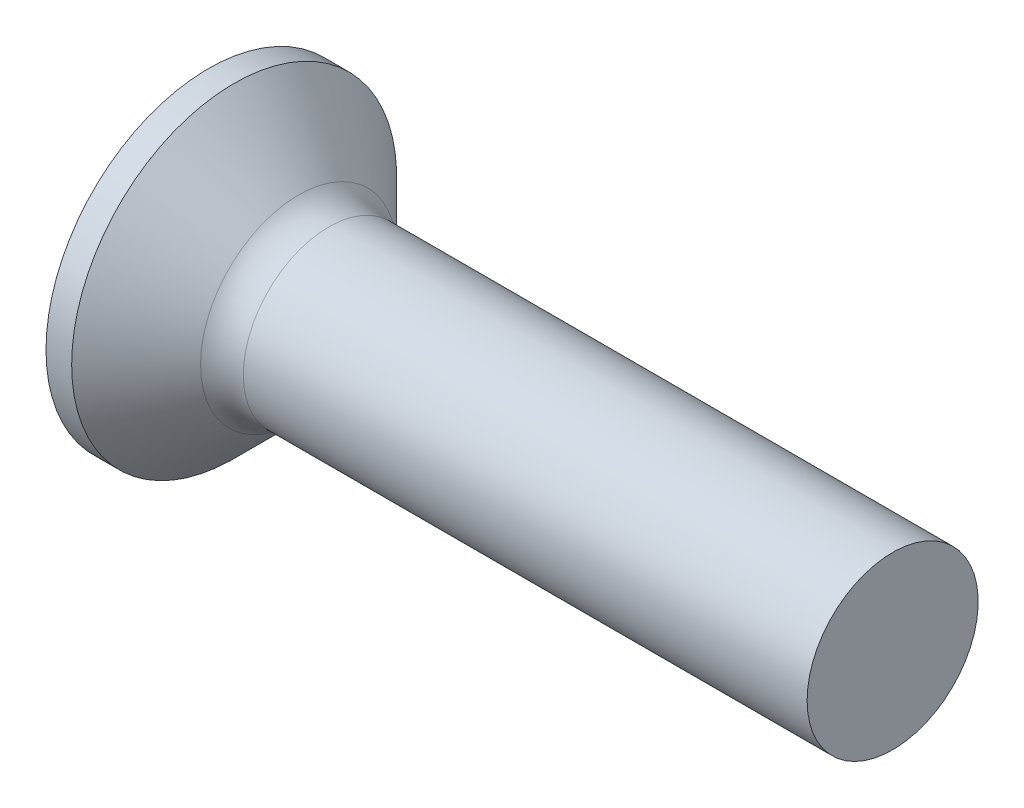
ISO-10303-21;
HEADER;
FILE_DESCRIPTION(('STEP AP214'),'2;1');
FILE_NAME('part.step','',(''),(''),'','','');
FILE_SCHEMA(('AUTOMOTIVE_DESIGN { 1 0 10303 214 1 1 1 1 }'));
ENDSEC;
DATA;
#1=APPLICATION_CONTEXT('core data for automotive mechanical design processes');
#2=APPLICATION_PROTOCOL_DEFINITION('international standard','automotive_design',2000,#1);
#3=PRODUCT_CONTEXT('',#1,'mechanical');
#4=PRODUCT('Part','Part','',(#3));
#5=PRODUCT_RELATED_PRODUCT_CATEGORY('part','',(#4));
#6=PRODUCT_DEFINITION_FORMATION('','',#4);
#7=PRODUCT_DEFINITION_CONTEXT('part definition',#1,'design');
#8=PRODUCT_DEFINITION('design','',#6,#7);
#9=PRODUCT_DEFINITION_SHAPE('','',#8);
#10=(LENGTH_UNIT() NAMED_UNIT(*) SI_UNIT(.MILLI.,.METRE.));
#11=(NAMED_UNIT(*) PLANE_ANGLE_UNIT() SI_UNIT($,.RADIAN.));
#12=(NAMED_UNIT(*) SI_UNIT($,.STERADIAN.) SOLID_ANGLE_UNIT());
#13=UNCERTAINTY_MEASURE_WITH_UNIT(LENGTH_MEASURE(1.E-05),#10,'distance_accuracy_value','');
#14=(GEOMETRIC_REPRESENTATION_CONTEXT(3) GLOBAL_UNCERTAINTY_ASSIGNED_CONTEXT((#13)) GLOBAL_UNIT_ASSIGNED_CONTEXT((#10,
#11,#12)) REPRESENTATION_CONTEXT('',''));
#15=CARTESIAN_POINT('',(0.,0.,0.));
#16=DIRECTION('',(0.,0.,1.));
#17=DIRECTION('',(1.,0.,0.));
#18=AXIS2_PLACEMENT_3D('',#15,#16,#17);
#19=CARTESIAN_POINT('',(0.,0.,0.));
#20=DIRECTION('',(-1.,0.,0.));
#21=DIRECTION('',(0.,0.,1.));
#22=AXIS2_PLACEMENT_3D('',#19,#20,#21);
#23=PLANE('',#22);
#24=CARTESIAN_POINT('',(0.,0.,0.));
#25=DIRECTION('',(-1.,0.,0.));
#26=DIRECTION('',(0.,0.,1.));
#27=AXIS2_PLACEMENT_3D('',#24,#25,#26);
#28=CIRCLE('',#27,1.9);
#29=CARTESIAN_POINT('',(0.,0.,1.9));
#30=VERTEX_POINT('',#29);
#31=EDGE_CURVE('E345',#30,#30,#28,.T.);
#32=ORIENTED_EDGE('',*,*,#31,.T.);
#33=EDGE_LOOP('',(#32));
#34=FACE_BOUND('',#33,.T.);
#35=DIRECTION('',(0.,0.,-1.));
#36=VECTOR('',#35,1.);
#37=CARTESIAN_POINT('',(0.,-0.240000000000003,0.949999999999999));
#38=LINE('',#37,#36);
#39=CARTESIAN_POINT('',(0.,-0.240000000000003,0.949999999999999));
#40=VERTEX_POINT('',#39);
#41=CARTESIAN_POINT('',(0.,-0.240000000000001,0.368080234393745));
#42=VERTEX_POINT('',#41);
#43=EDGE_CURVE('E384',#40,#42,#38,.T.);
#44=ORIENTED_EDGE('',*,*,#43,.T.);
#45=CARTESIAN_POINT('',(0.,0.,0.));
#46=DIRECTION('',(-1.,0.,0.));
#47=DIRECTION('',(0.,0.,1.));
#48=AXIS2_PLACEMENT_3D('',#45,#46,#47);
#49=CIRCLE('',#48,0.439412174332203);
#50=CARTESIAN_POINT('',(0.,-0.368080234393745,0.24));
#51=VERTEX_POINT('',#50);
#52=EDGE_CURVE('E371',#51,#42,#49,.T.);
#53=ORIENTED_EDGE('',*,*,#52,.F.);
#54=DIRECTION('',(0.,-1.,0.));
#55=VECTOR('',#54,1.);
#56=CARTESIAN_POINT('',(0.,0.95,0.24));
#57=LINE('',#56,#55);
#58=CARTESIAN_POINT('',(0.,-0.95,0.24));
#59=VERTEX_POINT('',#58);
#60=EDGE_CURVE('E431',#51,#59,#57,.T.);
#61=ORIENTED_EDGE('',*,*,#60,.T.);
#62=DIRECTION('',(0.,0.,-1.));
#63=VECTOR('',#62,1.);
#64=CARTESIAN_POINT('',(0.,-0.95,0.24));
#65=LINE('',#64,#63);
#66=CARTESIAN_POINT('',(0.,-0.95,-0.24));
#67=VERTEX_POINT('',#66);
#68=EDGE_CURVE('E342',#59,#67,#65,.T.);
#69=ORIENTED_EDGE('',*,*,#68,.T.);
#70=DIRECTION('',(0.,1.,0.));
#71=VECTOR('',#70,1.);
#72=CARTESIAN_POINT('',(0.,-0.95,-0.24));
#73=LINE('',#72,#71);
#74=CARTESIAN_POINT('',(0.,-0.368080234393745,-0.24));
#75=VERTEX_POINT('',#74);
#76=EDGE_CURVE('E432',#67,#75,#73,.T.);
#77=ORIENTED_EDGE('',*,*,#76,.T.);
#78=CARTESIAN_POINT('',(0.,-0.239999999999999,-0.368080234393746));
#79=VERTEX_POINT('',#78);
#80=EDGE_CURVE('E377',#79,#75,#49,.T.);
#81=ORIENTED_EDGE('',*,*,#80,.F.);
#82=CARTESIAN_POINT('',(0.,-0.239999999999997,-0.950000000000001));
#83=VERTEX_POINT('',#82);
#84=EDGE_CURVE('E393',#79,#83,#38,.T.);
#85=ORIENTED_EDGE('',*,*,#84,.T.);
#86=DIRECTION('',(0.,1.,0.));
#87=VECTOR('',#86,1.);
#88=CARTESIAN_POINT('',(0.,-0.239999999999997,-0.950000000000001));
#89=LINE('',#88,#87);
#90=CARTESIAN_POINT('',(0.,0.240000000000003,-0.949999999999999));
#91=VERTEX_POINT('',#90);
#92=EDGE_CURVE('E392',#83,#91,#89,.T.);
#93=ORIENTED_EDGE('',*,*,#92,.T.);
#94=DIRECTION('',(0.,0.,1.));
#95=VECTOR('',#94,1.);
#96=CARTESIAN_POINT('',(0.,0.240000000000003,-0.949999999999999));
#97=LINE('',#96,#95);
#98=CARTESIAN_POINT('',(0.,0.240000000000001,-0.368080234393745));
#99=VERTEX_POINT('',#98);
#100=EDGE_CURVE('E399',#91,#99,#97,.T.);
#101=ORIENTED_EDGE('',*,*,#100,.T.);
#102=CARTESIAN_POINT('',(0.,0.368080234393745,-0.24));
#103=VERTEX_POINT('',#102);
#104=EDGE_CURVE('E467',#103,#99,#49,.T.);
#105=ORIENTED_EDGE('',*,*,#104,.F.);
#106=CARTESIAN_POINT('',(0.,0.95,-0.24));
#107=VERTEX_POINT('',#106);
#108=EDGE_CURVE('E440',#103,#107,#73,.T.);
#109=ORIENTED_EDGE('',*,*,#108,.T.);
#110=DIRECTION('',(0.,0.,1.));
#111=VECTOR('',#110,1.);
#112=CARTESIAN_POINT('',(0.,0.95,-0.24));
#113=LINE('',#112,#111);
#114=CARTESIAN_POINT('',(0.,0.95,0.24));
#115=VERTEX_POINT('',#114);
#116=EDGE_CURVE('E428',#107,#115,#113,.T.);
#117=ORIENTED_EDGE('',*,*,#116,.T.);
#118=CARTESIAN_POINT('',(0.,0.368080234393745,0.24));
#119=VERTEX_POINT('',#118);
#120=EDGE_CURVE('E433',#115,#119,#57,.T.);
#121=ORIENTED_EDGE('',*,*,#120,.T.);
#122=CARTESIAN_POINT('',(0.,0.239999999999999,0.368080234393746));
#123=VERTEX_POINT('',#122);
#124=EDGE_CURVE('E379',#123,#119,#49,.T.);
#125=ORIENTED_EDGE('',*,*,#124,.F.);
#126=CARTESIAN_POINT('',(0.,0.239999999999997,0.950000000000001));
#127=VERTEX_POINT('',#126);
#128=EDGE_CURVE('E402',#123,#127,#97,.T.);
#129=ORIENTED_EDGE('',*,*,#128,.T.);
#130=DIRECTION('',(0.,-1.,0.));
#131=VECTOR('',#130,1.);
#132=CARTESIAN_POINT('',(0.,0.239999999999997,0.950000000000001));
#133=LINE('',#132,#131);
#134=EDGE_CURVE('E391',#127,#40,#133,.T.);
#135=ORIENTED_EDGE('',*,*,#134,.T.);
#136=EDGE_LOOP('',(#44,#53,#61,#69,#77,#81,#85,#93,#101,#105,#109,#117,#121,#125,#129,#135));
#137=FACE_BOUND('',#136,.T.);
#138=ADVANCED_FACE('F38',(#34,#137),#23,.T.);
#139=CARTESIAN_POINT('',(0.,-0.949999999999999,0.24));
#140=DIRECTION('',(0.,0.,-1.));
#141=DIRECTION('',(0.,1.,0.));
#142=AXIS2_PLACEMENT_3D('',#139,#140,#141);
#143=PLANE('',#142);
#144=ORIENTED_EDGE('',*,*,#60,.F.);
#145=CARTESIAN_POINT('',(-0.647693210421638,-0.421114336989891,0.24));
#146=CARTESIAN_POINT('',(-0.514503449539821,-0.410390261082994,0.24));
#147=CARTESIAN_POINT('',(-0.381320940230654,-0.399574318210381,0.24));
#148=CARTESIAN_POINT('',(-0.114973765657541,-0.377686644384344,0.24));
#149=CARTESIAN_POINT('',(0.0181908991048064,-0.366614907333785,0.24));
#150=CARTESIAN_POINT('',(0.284492634007954,-0.344144100394554,0.24));
#151=CARTESIAN_POINT('',(0.417629704159725,-0.332745030636282,0.24));
#152=CARTESIAN_POINT('',(0.683863247577946,-0.309504122508032,0.24));
#153=CARTESIAN_POINT('',(0.816959721458451,-0.297662291208049,0.24));
#154=CARTESIAN_POINT('',(1.04303435438055,-0.277010154534468,0.24));
#155=CARTESIAN_POINT('',(1.13602713245196,-0.268360479226193,0.24));
#156=CARTESIAN_POINT('',(1.32197255819723,-0.250648380041589,0.24));
#157=CARTESIAN_POINT('',(1.41492520622595,-0.241585959893612,0.24));
#158=CARTESIAN_POINT('',(1.60078125425266,-0.222904447218474,0.24));
#159=CARTESIAN_POINT('',(1.69368465086432,-0.213285320435301,0.24));
#160=CARTESIAN_POINT('',(1.87939874419459,-0.193166747195666,0.24));
#161=CARTESIAN_POINT('',(1.97220943766423,-0.182667270910302,0.24));
#162=CARTESIAN_POINT('',(2.0649517678624,-0.171565852393332,0.24));
#163=B_SPLINE_CURVE_WITH_KNOTS('',3,(#145,#146,#147,#148,#149,#150,#151,#152,#153,#154,#155,
#156,#157,#158,#159,#160,#161,#162),.UNSPECIFIED.,.F.,.F.,(4,2,2,2,2,2,2,2,4),(0.,
0.400862588724007,0.801734742325294,1.2026067362345,1.60347233177046,1.88365413960954,
2.16383341704974,2.44402995322111,2.72423598713696),.UNSPECIFIED.);
#164=CARTESIAN_POINT('',(1.2,-0.262259890185288,0.240000000000001));
#165=VERTEX_POINT('',#164);
#166=EDGE_CURVE('E374',#51,#165,#163,.T.);
#167=ORIENTED_EDGE('',*,*,#166,.T.);
#168=DIRECTION('',(0.,-1.,0.));
#169=VECTOR('',#168,1.);
#170=CARTESIAN_POINT('',(1.2,0.351702090980209,0.24));
#171=LINE('',#170,#169);
#172=CARTESIAN_POINT('',(1.2,-0.351702090980209,0.24));
#173=VERTEX_POINT('',#172);
#174=EDGE_CURVE('E447',#165,#173,#171,.T.);
#175=ORIENTED_EDGE('',*,*,#174,.T.);
#176=DIRECTION('',(0.89493436774996,0.446197800778958,0.));
#177=VECTOR('',#176,1.);
#178=CARTESIAN_POINT('',(0.,-0.95,0.24));
#179=LINE('',#178,#177);
#180=EDGE_CURVE('E320',#59,#173,#179,.T.);
#181=ORIENTED_EDGE('',*,*,#180,.F.);
#182=EDGE_LOOP('',(#144,#167,#175,#181));
#183=FACE_BOUND('',#182,.T.);
#184=ADVANCED_FACE('F192',(#183),#143,.T.);
#185=CARTESIAN_POINT('',(1.2,0.351702090980209,0.24));
#186=VERTEX_POINT('',#185);
#187=CARTESIAN_POINT('',(1.2,0.262259890185288,0.24));
#188=VERTEX_POINT('',#187);
#189=EDGE_CURVE('E329',#186,#188,#171,.T.);
#190=ORIENTED_EDGE('',*,*,#189,.T.);
#191=CARTESIAN_POINT('',(-0.647693210421638,0.421114336989891,0.24));
#192=CARTESIAN_POINT('',(-0.514503449539821,0.410390261082994,0.24));
#193=CARTESIAN_POINT('',(-0.381320940230654,0.399574318210381,0.24));
#194=CARTESIAN_POINT('',(-0.114973765657541,0.377686644384344,0.24));
#195=CARTESIAN_POINT('',(0.0181908991048065,0.366614907333785,0.24));
#196=CARTESIAN_POINT('',(0.284492634007954,0.344144100394554,0.24));
#197=CARTESIAN_POINT('',(0.417629704159725,0.332745030636282,0.24));
#198=CARTESIAN_POINT('',(0.683863247577946,0.309504122508032,0.24));
#199=CARTESIAN_POINT('',(0.816959721458451,0.297662291208049,0.24));
#200=CARTESIAN_POINT('',(1.04303435438056,0.277010154534468,0.24));
#201=CARTESIAN_POINT('',(1.13602713245196,0.268360479226193,0.24));
#202=CARTESIAN_POINT('',(1.32197255819723,0.250648380041589,0.24));
#203=CARTESIAN_POINT('',(1.41492520622595,0.241585959893612,0.24));
#204=CARTESIAN_POINT('',(1.60078125425266,0.222904447218474,0.24));
#205=CARTESIAN_POINT('',(1.69368465086432,0.213285320435301,0.24));
#206=CARTESIAN_POINT('',(1.87939874419459,0.193166747195666,0.24));
#207=CARTESIAN_POINT('',(1.97220943766423,0.182667270910302,0.24));
#208=CARTESIAN_POINT('',(2.0649517678624,0.171565852393332,0.24));
#209=B_SPLINE_CURVE_WITH_KNOTS('',3,(#191,#192,#193,#194,#195,#196,#197,#198,#199,#200,#201,
#202,#203,#204,#205,#206,#207,#208),.UNSPECIFIED.,.F.,.F.,(4,2,2,2,2,2,2,2,4),(0.,
0.400862588724007,0.801734742325293,1.2026067362345,1.60347233177046,1.88365413960954,
2.16383341704974,2.44402995322111,2.72423598713696),.UNSPECIFIED.);
#210=EDGE_CURVE('E252',#188,#119,#209,.F.);
#211=ORIENTED_EDGE('',*,*,#210,.T.);
#212=ORIENTED_EDGE('',*,*,#120,.F.);
#213=DIRECTION('',(0.89493436774996,-0.446197800778958,0.));
#214=VECTOR('',#213,1.);
#215=CARTESIAN_POINT('',(0.,0.95,0.24));
#216=LINE('',#215,#214);
#217=EDGE_CURVE('E61',#115,#186,#216,.T.);
#218=ORIENTED_EDGE('',*,*,#217,.T.);
#219=EDGE_LOOP('',(#190,#211,#212,#218));
#220=FACE_BOUND('',#219,.T.);
#221=ADVANCED_FACE('F197',(#220),#143,.T.);
#222=CARTESIAN_POINT('',(0.,0.949999999999999,-0.24));
#223=DIRECTION('',(0.,0.,1.));
#224=DIRECTION('',(1.,0.,0.));
#225=AXIS2_PLACEMENT_3D('',#222,#223,#224);
#226=PLANE('',#225);
#227=DIRECTION('',(0.,1.,0.));
#228=VECTOR('',#227,1.);
#229=CARTESIAN_POINT('',(1.2,-0.351702090980209,-0.24));
#230=LINE('',#229,#228);
#231=CARTESIAN_POINT('',(1.2,-0.351702090980209,-0.24));
#232=VERTEX_POINT('',#231);
#233=CARTESIAN_POINT('',(1.2,-0.262259890185288,-0.24));
#234=VERTEX_POINT('',#233);
#235=EDGE_CURVE('E333',#232,#234,#230,.T.);
#236=ORIENTED_EDGE('',*,*,#235,.T.);
#237=CARTESIAN_POINT('',(-0.647693210421638,-0.421114336989891,-0.24));
#238=CARTESIAN_POINT('',(-0.514503449539821,-0.410390261082994,-0.24));
#239=CARTESIAN_POINT('',(-0.381320940230654,-0.399574318210381,-0.24));
#240=CARTESIAN_POINT('',(-0.114973765657541,-0.377686644384344,-0.24));
#241=CARTESIAN_POINT('',(0.0181908991048066,-0.366614907333785,-0.24));
#242=CARTESIAN_POINT('',(0.284492634007954,-0.344144100394554,-0.24));
#243=CARTESIAN_POINT('',(0.417629704159725,-0.332745030636282,-0.24));
#244=CARTESIAN_POINT('',(0.683863247577946,-0.309504122508032,-0.24));
#245=CARTESIAN_POINT('',(0.816959721458451,-0.297662291208049,-0.24));
#246=CARTESIAN_POINT('',(1.04303435438056,-0.277010154534468,-0.24));
#247=CARTESIAN_POINT('',(1.13602713245196,-0.268360479226193,-0.24));
#248=CARTESIAN_POINT('',(1.32197255819723,-0.250648380041589,-0.24));
#249=CARTESIAN_POINT('',(1.41492520622595,-0.241585959893612,-0.24));
#250=CARTESIAN_POINT('',(1.60078125425266,-0.222904447218474,-0.24));
#251=CARTESIAN_POINT('',(1.69368465086432,-0.213285320435301,-0.24));
#252=CARTESIAN_POINT('',(1.87939874419459,-0.193166747195666,-0.24));
#253=CARTESIAN_POINT('',(1.97220943766423,-0.182667270910302,-0.24));
#254=CARTESIAN_POINT('',(2.0649517678624,-0.171565852393332,-0.24));
#255=B_SPLINE_CURVE_WITH_KNOTS('',3,(#237,#238,#239,#240,#241,#242,#243,#244,#245,#246,#247,
#248,#249,#250,#251,#252,#253,#254),.UNSPECIFIED.,.F.,.F.,(4,2,2,2,2,2,2,2,4),(0.,
0.400862588724007,0.801734742325294,1.2026067362345,1.60347233177046,1.88365413960954,
2.16383341704974,2.44402995322111,2.72423598713696),.UNSPECIFIED.);
#256=EDGE_CURVE('E246',#234,#75,#255,.F.);
#257=ORIENTED_EDGE('',*,*,#256,.T.);
#258=ORIENTED_EDGE('',*,*,#76,.F.);
#259=DIRECTION('',(0.89493436774996,0.446197800778958,0.));
#260=VECTOR('',#259,1.);
#261=CARTESIAN_POINT('',(0.,-0.95,-0.24));
#262=LINE('',#261,#260);
#263=EDGE_CURVE('E442',#67,#232,#262,.T.);
#264=ORIENTED_EDGE('',*,*,#263,.T.);
#265=EDGE_LOOP('',(#236,#257,#258,#264));
#266=FACE_BOUND('',#265,.T.);
#267=ADVANCED_FACE('F232',(#266),#226,.T.);
#268=ORIENTED_EDGE('',*,*,#108,.F.);
#269=CARTESIAN_POINT('',(-0.647693210410767,0.421114336989016,-0.24));
#270=CARTESIAN_POINT('',(-0.514503449530112,0.410390261082207,-0.24));
#271=CARTESIAN_POINT('',(-0.381320940222106,0.399574318209684,-0.24));
#272=CARTESIAN_POINT('',(-0.114973765651316,0.377686644383828,-0.24));
#273=CARTESIAN_POINT('',(0.0181908991098697,0.366614907333361,-0.24));
#274=CARTESIAN_POINT('',(0.284492634009302,0.344144100394437,-0.24));
#275=CARTESIAN_POINT('',(0.417629704158519,0.332745030636383,-0.24));
#276=CARTESIAN_POINT('',(0.683863247571635,0.309504122508587,-0.24));
#277=CARTESIAN_POINT('',(0.816959721449588,0.29766229120884,-0.24));
#278=CARTESIAN_POINT('',(1.04303435436914,0.277010154535523,-0.24));
#279=CARTESIAN_POINT('',(1.13602713244054,0.268360479227263,-0.24));
#280=CARTESIAN_POINT('',(1.32197255818582,0.250648380042693,-0.24));
#281=CARTESIAN_POINT('',(1.41492520621454,0.241585959894735,-0.24));
#282=CARTESIAN_POINT('',(1.60078125424125,0.222904447219644,-0.24));
#283=CARTESIAN_POINT('',(1.69368465085292,0.213285320436499,-0.24));
#284=CARTESIAN_POINT('',(1.8793987441832,0.193166747196935,-0.24));
#285=CARTESIAN_POINT('',(1.97220943765284,0.182667270911615,-0.24));
#286=CARTESIAN_POINT('',(2.06495176785102,0.171565852394701,-0.24));
#287=B_SPLINE_CURVE_WITH_KNOTS('',3,(#269,#270,#271,#272,#273,#274,#275,#276,#277,#278,#279,
#280,#281,#282,#283,#284,#285,#286),.UNSPECIFIED.,.F.,.F.,(4,2,2,2,2,2,2,2,4),(0.,
0.400862588720512,0.801734742318303,1.20260673621982,1.60347233174809,1.88365413958718,
2.16383341702737,2.44402995319874,2.72423598711459),.UNSPECIFIED.);
#288=CARTESIAN_POINT('',(1.2,0.262259890185288,-0.24));
#289=VERTEX_POINT('',#288);
#290=EDGE_CURVE('E240',#103,#289,#287,.T.);
#291=ORIENTED_EDGE('',*,*,#290,.T.);
#292=CARTESIAN_POINT('',(1.2,0.351702090980209,-0.24));
#293=VERTEX_POINT('',#292);
#294=EDGE_CURVE('E337',#289,#293,#230,.T.);
#295=ORIENTED_EDGE('',*,*,#294,.T.);
#296=DIRECTION('',(0.89493436774996,-0.446197800778958,0.));
#297=VECTOR('',#296,1.);
#298=CARTESIAN_POINT('',(0.,0.95,-0.24));
#299=LINE('',#298,#297);
#300=EDGE_CURVE('E324',#107,#293,#299,.T.);
#301=ORIENTED_EDGE('',*,*,#300,.F.);
#302=EDGE_LOOP('',(#268,#291,#295,#301));
#303=FACE_BOUND('',#302,.T.);
#304=ADVANCED_FACE('F224',(#303),#226,.T.);
#305=CARTESIAN_POINT('',(1.2,0.351702090980209,-0.24));
#306=DIRECTION('',(1.,0.,0.));
#307=DIRECTION('',(0.,0.,-1.));
#308=AXIS2_PLACEMENT_3D('',#305,#306,#307);
#309=PLANE('',#308);
#310=CARTESIAN_POINT('',(1.2,0.,0.));
#311=DIRECTION('',(-1.,0.,0.));
#312=DIRECTION('',(0.,0.,1.));
#313=AXIS2_PLACEMENT_3D('',#310,#311,#312);
#314=CIRCLE('',#313,0.355499999999999);
#315=CARTESIAN_POINT('',(1.2,-0.051825565121357,-0.351702090980209));
#316=VERTEX_POINT('',#315);
#317=CARTESIAN_POINT('',(1.2,-0.239999999999999,-0.262259890185289));
#318=VERTEX_POINT('',#317);
#319=EDGE_CURVE('E514',#316,#318,#314,.T.);
#320=ORIENTED_EDGE('',*,*,#319,.F.);
#321=DIRECTION('',(0.,1.,0.));
#322=VECTOR('',#321,1.);
#323=CARTESIAN_POINT('',(1.2,-0.239999999999999,-0.35170209098021));
#324=LINE('',#323,#322);
#325=CARTESIAN_POINT('',(1.2,-0.239999999999999,-0.35170209098021));
#326=VERTEX_POINT('',#325);
#327=EDGE_CURVE('E414',#326,#316,#324,.T.);
#328=ORIENTED_EDGE('',*,*,#327,.F.);
#329=DIRECTION('',(0.,0.,-1.));
#330=VECTOR('',#329,1.);
#331=CARTESIAN_POINT('',(1.2,-0.240000000000001,0.351702090980208));
#332=LINE('',#331,#330);
#333=EDGE_CURVE('E418',#318,#326,#332,.T.);
#334=ORIENTED_EDGE('',*,*,#333,.F.);
#335=EDGE_LOOP('',(#320,#328,#334));
#336=FACE_BOUND('',#335,.T.);
#337=ADVANCED_FACE('F220',(#336),#309,.F.);
#338=CARTESIAN_POINT('',(1.2,-0.351702090980209,-0.0518255651213578));
#339=VERTEX_POINT('',#338);
#340=EDGE_CURVE('E485',#234,#339,#314,.T.);
#341=ORIENTED_EDGE('',*,*,#340,.F.);
#342=ORIENTED_EDGE('',*,*,#235,.F.);
#343=DIRECTION('',(0.,0.,-1.));
#344=VECTOR('',#343,1.);
#345=CARTESIAN_POINT('',(1.2,-0.351702090980209,0.24));
#346=LINE('',#345,#344);
#347=EDGE_CURVE('E325',#339,#232,#346,.T.);
#348=ORIENTED_EDGE('',*,*,#347,.F.);
#349=EDGE_LOOP('',(#341,#342,#348));
#350=FACE_BOUND('',#349,.T.);
#351=ADVANCED_FACE('F223',(#350),#309,.F.);
#352=CARTESIAN_POINT('',(1.2,-0.351702090980209,0.051825565121358));
#353=VERTEX_POINT('',#352);
#354=EDGE_CURVE('E481',#353,#165,#314,.T.);
#355=ORIENTED_EDGE('',*,*,#354,.F.);
#356=EDGE_CURVE('E315',#173,#353,#346,.T.);
#357=ORIENTED_EDGE('',*,*,#356,.F.);
#358=ORIENTED_EDGE('',*,*,#174,.F.);
#359=EDGE_LOOP('',(#355,#357,#358));
#360=FACE_BOUND('',#359,.T.);
#361=ADVANCED_FACE('F479',(#360),#309,.F.);
#362=CARTESIAN_POINT('',(1.2,-0.240000000000001,0.262259890185288));
#363=VERTEX_POINT('',#362);
#364=CARTESIAN_POINT('',(1.2,-0.0518255651213545,0.351702090980209));
#365=VERTEX_POINT('',#364);
#366=EDGE_CURVE('E53',#363,#365,#314,.T.);
#367=ORIENTED_EDGE('',*,*,#366,.F.);
#368=CARTESIAN_POINT('',(1.2,-0.240000000000001,0.351702090980209));
#369=VERTEX_POINT('',#368);
#370=EDGE_CURVE('E387',#369,#363,#332,.T.);
#371=ORIENTED_EDGE('',*,*,#370,.F.);
#372=DIRECTION('',(0.,-1.,0.));
#373=VECTOR('',#372,1.);
#374=CARTESIAN_POINT('',(1.2,0.239999999999999,0.35170209098021));
#375=LINE('',#374,#373);
#376=EDGE_CURVE('E419',#365,#369,#375,.T.);
#377=ORIENTED_EDGE('',*,*,#376,.F.);
#378=EDGE_LOOP('',(#367,#371,#377));
#379=FACE_BOUND('',#378,.T.);
#380=ADVANCED_FACE('F525',(#379),#309,.F.);
#381=CARTESIAN_POINT('',(1.2,0.0518255651213578,0.351702090980209));
#382=VERTEX_POINT('',#381);
#383=CARTESIAN_POINT('',(1.2,0.239999999999999,0.262259890185289));
#384=VERTEX_POINT('',#383);
#385=EDGE_CURVE('E378',#382,#384,#314,.T.);
#386=ORIENTED_EDGE('',*,*,#385,.F.);
#387=CARTESIAN_POINT('',(1.2,0.239999999999999,0.35170209098021));
#388=VERTEX_POINT('',#387);
#389=EDGE_CURVE('E415',#388,#382,#375,.T.);
#390=ORIENTED_EDGE('',*,*,#389,.F.);
#391=DIRECTION('',(0.,0.,1.));
#392=VECTOR('',#391,1.);
#393=CARTESIAN_POINT('',(1.2,0.240000000000001,-0.351702090980209));
#394=LINE('',#393,#392);
#395=EDGE_CURVE('E427',#384,#388,#394,.T.);
#396=ORIENTED_EDGE('',*,*,#395,.F.);
#397=EDGE_LOOP('',(#386,#390,#396));
#398=FACE_BOUND('',#397,.T.);
#399=ADVANCED_FACE('F490',(#398),#309,.F.);
#400=CARTESIAN_POINT('',(1.2,0.351702090980209,0.0518255651213586));
#401=VERTEX_POINT('',#400);
#402=EDGE_CURVE('E459',#188,#401,#314,.T.);
#403=ORIENTED_EDGE('',*,*,#402,.F.);
#404=ORIENTED_EDGE('',*,*,#189,.F.);
#405=DIRECTION('',(0.,0.,1.));
#406=VECTOR('',#405,1.);
#407=CARTESIAN_POINT('',(1.2,0.351702090980209,-0.24));
#408=LINE('',#407,#406);
#409=EDGE_CURVE('E336',#401,#186,#408,.T.);
#410=ORIENTED_EDGE('',*,*,#409,.F.);
#411=EDGE_LOOP('',(#403,#404,#410));
#412=FACE_BOUND('',#411,.T.);
#413=ADVANCED_FACE('F457',(#412),#309,.F.);
#414=CARTESIAN_POINT('',(1.2,0.351702090980209,-0.0518255651213588));
#415=VERTEX_POINT('',#414);
#416=EDGE_CURVE('E465',#415,#289,#314,.T.);
#417=ORIENTED_EDGE('',*,*,#416,.F.);
#418=EDGE_CURVE('E445',#293,#415,#408,.T.);
#419=ORIENTED_EDGE('',*,*,#418,.F.);
#420=ORIENTED_EDGE('',*,*,#294,.F.);
#421=EDGE_LOOP('',(#417,#419,#420));
#422=FACE_BOUND('',#421,.T.);
#423=ADVANCED_FACE('F309',(#422),#309,.F.);
#424=CARTESIAN_POINT('',(1.2,0.240000000000001,-0.262259890185288));
#425=VERTEX_POINT('',#424);
#426=CARTESIAN_POINT('',(1.2,0.0518255651213593,-0.351702090980209));
#427=VERTEX_POINT('',#426);
#428=EDGE_CURVE('E508',#425,#427,#314,.T.);
#429=ORIENTED_EDGE('',*,*,#428,.F.);
#430=CARTESIAN_POINT('',(1.2,0.240000000000001,-0.351702090980209));
#431=VERTEX_POINT('',#430);
#432=EDGE_CURVE('E424',#431,#425,#394,.T.);
#433=ORIENTED_EDGE('',*,*,#432,.F.);
#434=EDGE_CURVE('E421',#427,#431,#324,.T.);
#435=ORIENTED_EDGE('',*,*,#434,.F.);
#436=EDGE_LOOP('',(#429,#433,#435));
#437=FACE_BOUND('',#436,.T.);
#438=ADVANCED_FACE('F226',(#437),#309,.F.);
#439=CARTESIAN_POINT('',(0.,-0.95,-0.24));
#440=DIRECTION('',(-0.446197800778958,0.89493436774996,0.));
#441=DIRECTION('',(-0.89493436774996,-0.446197800778958,0.));
#442=AXIS2_PLACEMENT_3D('',#439,#440,#441);
#443=PLANE('',#442);
#444=ORIENTED_EDGE('',*,*,#356,.T.);
#445=CARTESIAN_POINT('',(1.81755030037573,-0.0438028797890924,0.));
#446=DIRECTION('',(-0.446197800778958,0.89493436774996,0.));
#447=DIRECTION('',(-0.89493436774996,-0.446197800778958,0.));
#448=AXIS2_PLACEMENT_3D('',#445,#446,#447);
#449=ELLIPSE('',#448,0.699951178008363,0.309229710740659);
#450=EDGE_CURVE('E316',#353,#339,#449,.F.);
#451=ORIENTED_EDGE('',*,*,#450,.T.);
#452=ORIENTED_EDGE('',*,*,#347,.T.);
#453=ORIENTED_EDGE('',*,*,#263,.F.);
#454=ORIENTED_EDGE('',*,*,#68,.F.);
#455=ORIENTED_EDGE('',*,*,#180,.T.);
#456=EDGE_LOOP('',(#444,#451,#452,#453,#454,#455));
#457=FACE_BOUND('',#456,.T.);
#458=ADVANCED_FACE('F231',(#457),#443,.T.);
#459=CARTESIAN_POINT('',(0.,0.95,0.24));
#460=DIRECTION('',(-0.446197800778958,-0.89493436774996,0.));
#461=DIRECTION('',(0.89493436774996,-0.446197800778958,0.));
#462=AXIS2_PLACEMENT_3D('',#459,#460,#461);
#463=PLANE('',#462);
#464=ORIENTED_EDGE('',*,*,#418,.T.);
#465=CARTESIAN_POINT('',(1.81755030037573,0.0438028797890924,0.));
#466=DIRECTION('',(-0.446197800778958,-0.89493436774996,0.));
#467=DIRECTION('',(-0.89493436774996,0.446197800778958,0.));
#468=AXIS2_PLACEMENT_3D('',#465,#466,#467);
#469=ELLIPSE('',#468,0.699951178008363,0.309229710740659);
#470=EDGE_CURVE('E293',#415,#401,#469,.F.);
#471=ORIENTED_EDGE('',*,*,#470,.T.);
#472=ORIENTED_EDGE('',*,*,#409,.T.);
#473=ORIENTED_EDGE('',*,*,#217,.F.);
#474=ORIENTED_EDGE('',*,*,#116,.F.);
#475=ORIENTED_EDGE('',*,*,#300,.T.);
#476=EDGE_LOOP('',(#464,#471,#472,#473,#474,#475));
#477=FACE_BOUND('',#476,.T.);
#478=ADVANCED_FACE('F227',(#477),#463,.T.);
#479=CARTESIAN_POINT('',(0.,0.239999999999997,0.95));
#480=DIRECTION('',(0.,-1.,0.));
#481=DIRECTION('',(1.,0.,0.));
#482=AXIS2_PLACEMENT_3D('',#479,#480,#481);
#483=PLANE('',#482);
#484=ORIENTED_EDGE('',*,*,#432,.T.);
#485=CARTESIAN_POINT('',(-0.647693210421638,0.240000000000001,-0.42111433698989));
#486=CARTESIAN_POINT('',(-0.514503449539822,0.240000000000001,-0.410390261082993));
#487=CARTESIAN_POINT('',(-0.381320940230654,0.240000000000001,-0.399574318210381));
#488=CARTESIAN_POINT('',(-0.114973765657541,0.240000000000001,-0.377686644384343));
#489=CARTESIAN_POINT('',(0.0181908991048064,0.240000000000001,-0.366614907333784));
#490=CARTESIAN_POINT('',(0.284492634007954,0.240000000000001,-0.344144100394553));
#491=CARTESIAN_POINT('',(0.417629704159725,0.240000000000001,-0.332745030636281));
#492=CARTESIAN_POINT('',(0.683863247577946,0.240000000000001,-0.309504122508031));
#493=CARTESIAN_POINT('',(0.816959721458451,0.240000000000001,-0.297662291208048));
#494=CARTESIAN_POINT('',(1.04303435438056,0.240000000000001,-0.277010154534467));
#495=CARTESIAN_POINT('',(1.13602713245196,0.240000000000001,-0.268360479226192));
#496=CARTESIAN_POINT('',(1.32197255819723,0.240000000000001,-0.250648380041589));
#497=CARTESIAN_POINT('',(1.41492520622595,0.240000000000001,-0.241585959893611));
#498=CARTESIAN_POINT('',(1.60078125425266,0.240000000000001,-0.222904447218473));
#499=CARTESIAN_POINT('',(1.69368465086432,0.240000000000001,-0.213285320435301));
#500=CARTESIAN_POINT('',(1.87939874419459,0.240000000000001,-0.193166747195665));
#501=CARTESIAN_POINT('',(1.97220943766423,0.240000000000001,-0.182667270910301));
#502=CARTESIAN_POINT('',(2.0649517678624,0.240000000000001,-0.171565852393331));
#503=B_SPLINE_CURVE_WITH_KNOTS('',3,(#485,#486,#487,#488,#489,#490,#491,#492,#493,#494,#495,
#496,#497,#498,#499,#500,#501,#502),.UNSPECIFIED.,.F.,.F.,(4,2,2,2,2,2,2,2,4),(0.,
0.400862588724007,0.801734742325294,1.2026067362345,1.60347233177046,1.88365413960954,
2.16383341704974,2.44402995322111,2.72423598713696),.UNSPECIFIED.);
#504=EDGE_CURVE('E286',#425,#99,#503,.F.);
#505=ORIENTED_EDGE('',*,*,#504,.T.);
#506=ORIENTED_EDGE('',*,*,#100,.F.);
#507=DIRECTION('',(0.89493436774996,0.,0.446197800778958));
#508=VECTOR('',#507,1.);
#509=CARTESIAN_POINT('',(0.,0.240000000000003,-0.949999999999999));
#510=LINE('',#509,#508);
#511=EDGE_CURVE('E406',#91,#431,#510,.T.);
#512=ORIENTED_EDGE('',*,*,#511,.T.);
#513=EDGE_LOOP('',(#484,#505,#506,#512));
#514=FACE_BOUND('',#513,.T.);
#515=ADVANCED_FACE('F230',(#514),#483,.T.);
#516=CARTESIAN_POINT('',(0.,-0.239999999999997,-0.95));
#517=DIRECTION('',(0.,1.,0.));
#518=DIRECTION('',(0.,0.,1.));
#519=AXIS2_PLACEMENT_3D('',#516,#517,#518);
#520=PLANE('',#519);
#521=ORIENTED_EDGE('',*,*,#84,.F.);
#522=CARTESIAN_POINT('',(-0.647693210410766,-0.239999999999999,-0.421114336989017));
#523=CARTESIAN_POINT('',(-0.514503449530112,-0.239999999999999,-0.410390261082208));
#524=CARTESIAN_POINT('',(-0.381320940222106,-0.239999999999999,-0.399574318209684));
#525=CARTESIAN_POINT('',(-0.114973765651316,-0.239999999999999,-0.377686644383829));
#526=CARTESIAN_POINT('',(0.0181908991098697,-0.239999999999999,-0.366614907333361));
#527=CARTESIAN_POINT('',(0.284492634009302,-0.239999999999999,-0.344144100394438));
#528=CARTESIAN_POINT('',(0.417629704158519,-0.239999999999999,-0.332745030636384));
#529=CARTESIAN_POINT('',(0.683863247571635,-0.239999999999999,-0.309504122508588));
#530=CARTESIAN_POINT('',(0.816959721449588,-0.239999999999999,-0.297662291208841));
#531=CARTESIAN_POINT('',(1.04303435436914,-0.239999999999999,-0.277010154535524));
#532=CARTESIAN_POINT('',(1.13602713244054,-0.239999999999999,-0.268360479227263));
#533=CARTESIAN_POINT('',(1.32197255818582,-0.239999999999999,-0.250648380042694));
#534=CARTESIAN_POINT('',(1.41492520621454,-0.239999999999999,-0.241585959894736));
#535=CARTESIAN_POINT('',(1.60078125424125,-0.239999999999999,-0.222904447219645));
#536=CARTESIAN_POINT('',(1.69368465085292,-0.239999999999999,-0.2132853204365));
#537=CARTESIAN_POINT('',(1.8793987441832,-0.239999999999999,-0.193166747196935));
#538=CARTESIAN_POINT('',(1.97220943765284,-0.239999999999999,-0.182667270911615));
#539=CARTESIAN_POINT('',(2.06495176785102,-0.239999999999999,-0.171565852394701));
#540=B_SPLINE_CURVE_WITH_KNOTS('',3,(#522,#523,#524,#525,#526,#527,#528,#529,#530,#531,#532,
#533,#534,#535,#536,#537,#538,#539),.UNSPECIFIED.,.F.,.F.,(4,2,2,2,2,2,2,2,4),(0.,
0.400862588720512,0.801734742318303,1.20260673621982,1.60347233174809,1.88365413958718,
2.16383341702737,2.44402995319874,2.72423598711459),.UNSPECIFIED.);
#541=EDGE_CURVE('E280',#79,#318,#540,.T.);
#542=ORIENTED_EDGE('',*,*,#541,.T.);
#543=ORIENTED_EDGE('',*,*,#333,.T.);
#544=DIRECTION('',(0.89493436774996,0.,0.446197800778958));
#545=VECTOR('',#544,1.);
#546=CARTESIAN_POINT('',(0.,-0.239999999999997,-0.950000000000001));
#547=LINE('',#546,#545);
#548=EDGE_CURVE('E403',#83,#326,#547,.T.);
#549=ORIENTED_EDGE('',*,*,#548,.F.);
#550=EDGE_LOOP('',(#521,#542,#543,#549));
#551=FACE_BOUND('',#550,.T.);
#552=ADVANCED_FACE('F297',(#551),#520,.T.);
#553=CARTESIAN_POINT('',(0.,0.240000000000003,-0.949999999999999));
#554=DIRECTION('',(-0.446197800778958,0.,0.89493436774996));
#555=DIRECTION('',(-0.89493436774996,0.,-0.446197800778958));
#556=AXIS2_PLACEMENT_3D('',#553,#554,#555);
#557=PLANE('',#556);
#558=ORIENTED_EDGE('',*,*,#327,.T.);
#559=CARTESIAN_POINT('',(1.81755030037573,0.,-0.0438028797890924));
#560=DIRECTION('',(-0.446197800778958,0.,0.89493436774996));
#561=DIRECTION('',(-0.89493436774996,0.,-0.446197800778958));
#562=AXIS2_PLACEMENT_3D('',#559,#560,#561);
#563=ELLIPSE('',#562,0.699951178008363,0.309229710740659);
#564=EDGE_CURVE('E388',#316,#427,#563,.F.);
#565=ORIENTED_EDGE('',*,*,#564,.T.);
#566=ORIENTED_EDGE('',*,*,#434,.T.);
#567=ORIENTED_EDGE('',*,*,#511,.F.);
#568=ORIENTED_EDGE('',*,*,#92,.F.);
#569=ORIENTED_EDGE('',*,*,#548,.T.);
#570=EDGE_LOOP('',(#558,#565,#566,#567,#568,#569));
#571=FACE_BOUND('',#570,.T.);
#572=ADVANCED_FACE('F259',(#571),#557,.T.);
#573=ORIENTED_EDGE('',*,*,#370,.T.);
#574=CARTESIAN_POINT('',(-0.647693210421638,-0.240000000000001,0.42111433698989));
#575=CARTESIAN_POINT('',(-0.514503449539822,-0.240000000000001,0.410390261082993));
#576=CARTESIAN_POINT('',(-0.381320940230654,-0.240000000000001,0.39957431821038));
#577=CARTESIAN_POINT('',(-0.114973765657541,-0.240000000000001,0.377686644384343));
#578=CARTESIAN_POINT('',(0.0181908991048064,-0.240000000000001,0.366614907333784));
#579=CARTESIAN_POINT('',(0.284492634007953,-0.240000000000001,0.344144100394553));
#580=CARTESIAN_POINT('',(0.417629704159725,-0.240000000000001,0.332745030636281));
#581=CARTESIAN_POINT('',(0.683863247577946,-0.240000000000001,0.309504122508031));
#582=CARTESIAN_POINT('',(0.816959721458451,-0.240000000000001,0.297662291208048));
#583=CARTESIAN_POINT('',(1.04303435438056,-0.240000000000001,0.277010154534467));
#584=CARTESIAN_POINT('',(1.13602713245196,-0.240000000000001,0.268360479226192));
#585=CARTESIAN_POINT('',(1.32197255819723,-0.240000000000001,0.250648380041589));
#586=CARTESIAN_POINT('',(1.41492520622595,-0.240000000000001,0.241585959893611));
#587=CARTESIAN_POINT('',(1.60078125425266,-0.240000000000001,0.222904447218473));
#588=CARTESIAN_POINT('',(1.69368465086432,-0.240000000000001,0.213285320435301));
#589=CARTESIAN_POINT('',(1.87939874419459,-0.240000000000001,0.193166747195665));
#590=CARTESIAN_POINT('',(1.97220943766423,-0.240000000000001,0.182667270910301));
#591=CARTESIAN_POINT('',(2.0649517678624,-0.240000000000001,0.171565852393331));
#592=B_SPLINE_CURVE_WITH_KNOTS('',3,(#574,#575,#576,#577,#578,#579,#580,#581,#582,#583,#584,
#585,#586,#587,#588,#589,#590,#591),.UNSPECIFIED.,.F.,.F.,(4,2,2,2,2,2,2,2,4),(0.,
0.400862588724007,0.801734742325293,1.2026067362345,1.60347233177046,1.88365413960955,
2.16383341704974,2.44402995322111,2.72423598713696),.UNSPECIFIED.);
#593=EDGE_CURVE('E273',#363,#42,#592,.F.);
#594=ORIENTED_EDGE('',*,*,#593,.T.);
#595=ORIENTED_EDGE('',*,*,#43,.F.);
#596=DIRECTION('',(0.89493436774996,0.,-0.446197800778958));
#597=VECTOR('',#596,1.);
#598=CARTESIAN_POINT('',(0.,-0.240000000000003,0.949999999999999));
#599=LINE('',#598,#597);
#600=EDGE_CURVE('E409',#40,#369,#599,.T.);
#601=ORIENTED_EDGE('',*,*,#600,.T.);
#602=EDGE_LOOP('',(#573,#594,#595,#601));
#603=FACE_BOUND('',#602,.T.);
#604=ADVANCED_FACE('F382',(#603),#520,.T.);
#605=ORIENTED_EDGE('',*,*,#128,.F.);
#606=CARTESIAN_POINT('',(-0.647693210421638,0.239999999999998,0.421114336989892));
#607=CARTESIAN_POINT('',(-0.514503449539821,0.239999999999998,0.410390261082995));
#608=CARTESIAN_POINT('',(-0.381320940230654,0.239999999999998,0.399574318210382));
#609=CARTESIAN_POINT('',(-0.114973765657541,0.239999999999999,0.377686644384345));
#610=CARTESIAN_POINT('',(0.0181908991048066,0.239999999999999,0.366614907333785));
#611=CARTESIAN_POINT('',(0.284492634007954,0.239999999999999,0.344144100394555));
#612=CARTESIAN_POINT('',(0.417629704159725,0.239999999999999,0.332745030636283));
#613=CARTESIAN_POINT('',(0.683863247577946,0.239999999999999,0.309504122508033));
#614=CARTESIAN_POINT('',(0.816959721458451,0.239999999999999,0.29766229120805));
#615=CARTESIAN_POINT('',(1.04303435438056,0.239999999999999,0.277010154534469));
#616=CARTESIAN_POINT('',(1.13602713245196,0.239999999999999,0.268360479226194));
#617=CARTESIAN_POINT('',(1.32197255819723,0.239999999999999,0.25064838004159));
#618=CARTESIAN_POINT('',(1.41492520622595,0.239999999999999,0.241585959893613));
#619=CARTESIAN_POINT('',(1.60078125425266,0.239999999999999,0.222904447218474));
#620=CARTESIAN_POINT('',(1.69368465086432,0.239999999999999,0.213285320435302));
#621=CARTESIAN_POINT('',(1.87939874419459,0.239999999999999,0.193166747195667));
#622=CARTESIAN_POINT('',(1.97220943766423,0.239999999999999,0.182667270910303));
#623=CARTESIAN_POINT('',(2.0649517678624,0.239999999999999,0.171565852393333));
#624=B_SPLINE_CURVE_WITH_KNOTS('',3,(#606,#607,#608,#609,#610,#611,#612,#613,#614,#615,#616,
#617,#618,#619,#620,#621,#622,#623),.UNSPECIFIED.,.F.,.F.,(4,2,2,2,2,2,2,2,4),(0.,
0.400862588724007,0.801734742325293,1.2026067362345,1.60347233177046,1.88365413960955,
2.16383341704974,2.44402995322111,2.72423598713696),.UNSPECIFIED.);
#625=EDGE_CURVE('E264',#123,#384,#624,.T.);
#626=ORIENTED_EDGE('',*,*,#625,.T.);
#627=ORIENTED_EDGE('',*,*,#395,.T.);
#628=DIRECTION('',(0.89493436774996,0.,-0.446197800778958));
#629=VECTOR('',#628,1.);
#630=CARTESIAN_POINT('',(0.,0.239999999999997,0.950000000000001));
#631=LINE('',#630,#629);
#632=EDGE_CURVE('E411',#127,#388,#631,.T.);
#633=ORIENTED_EDGE('',*,*,#632,.F.);
#634=EDGE_LOOP('',(#605,#626,#627,#633));
#635=FACE_BOUND('',#634,.T.);
#636=ADVANCED_FACE('F299',(#635),#483,.T.);
#637=CARTESIAN_POINT('',(0.,-0.240000000000003,0.949999999999999));
#638=DIRECTION('',(-0.446197800778958,0.,-0.89493436774996));
#639=DIRECTION('',(0.89493436774996,0.,-0.446197800778958));
#640=AXIS2_PLACEMENT_3D('',#637,#638,#639);
#641=PLANE('',#640);
#642=ORIENTED_EDGE('',*,*,#389,.T.);
#643=CARTESIAN_POINT('',(1.81755030037573,0.,0.0438028797890924));
#644=DIRECTION('',(-0.446197800778958,0.,-0.89493436774996));
#645=DIRECTION('',(-0.89493436774996,0.,0.446197800778958));
#646=AXIS2_PLACEMENT_3D('',#643,#644,#645);
#647=ELLIPSE('',#646,0.699951178008363,0.309229710740659);
#648=EDGE_CURVE('E11',#382,#365,#647,.F.);
#649=ORIENTED_EDGE('',*,*,#648,.T.);
#650=ORIENTED_EDGE('',*,*,#376,.T.);
#651=ORIENTED_EDGE('',*,*,#600,.F.);
#652=ORIENTED_EDGE('',*,*,#134,.F.);
#653=ORIENTED_EDGE('',*,*,#632,.T.);
#654=EDGE_LOOP('',(#642,#649,#650,#651,#652,#653));
#655=FACE_BOUND('',#654,.T.);
#656=ADVANCED_FACE('F207',(#655),#641,.T.);
#657=CARTESIAN_POINT('',(-6.34999999999999,0.,0.));
#658=DIRECTION('',(-1.,0.,0.));
#659=DIRECTION('',(0.,0.,1.));
#660=AXIS2_PLACEMENT_3D('',#657,#658,#659);
#661=CYLINDRICAL_SURFACE('',#660,1.9);
#662=CARTESIAN_POINT('',(0.300000000000003,0.,0.));
#663=DIRECTION('',(-1.,0.,0.));
#664=DIRECTION('',(0.,0.,1.));
#665=AXIS2_PLACEMENT_3D('',#662,#663,#664);
#666=CIRCLE('',#665,1.9);
#667=CARTESIAN_POINT('',(0.300000000000003,0.,1.9));
#668=VERTEX_POINT('',#667);
#669=EDGE_CURVE('E341',#668,#668,#666,.T.);
#670=ORIENTED_EDGE('',*,*,#669,.T.);
#671=EDGE_LOOP('',(#670));
#672=FACE_BOUND('',#671,.T.);
#673=ORIENTED_EDGE('',*,*,#31,.F.);
#674=EDGE_LOOP('',(#673));
#675=FACE_BOUND('',#674,.T.);
#676=ADVANCED_FACE('F203',(#672,#675),#661,.T.);
#677=CARTESIAN_POINT('',(0.300000000000003,0.,0.));
#678=DIRECTION('',(-1.,0.,0.));
#679=DIRECTION('',(0.,0.,1.));
#680=AXIS2_PLACEMENT_3D('',#677,#678,#679);
#681=CONICAL_SURFACE('',#680,1.9,0.78539816339745);
#682=CARTESIAN_POINT('',(1.05355339059327,0.,0.));
#683=DIRECTION('',(-1.,0.,0.));
#684=DIRECTION('',(0.,0.,1.));
#685=AXIS2_PLACEMENT_3D('',#682,#683,#684);
#686=CIRCLE('',#685,1.14644660940673);
#687=CARTESIAN_POINT('',(1.05355339059327,0.,1.14644660940673));
#688=VERTEX_POINT('',#687);
#689=EDGE_CURVE('E347',#688,#688,#686,.T.);
#690=ORIENTED_EDGE('',*,*,#689,.T.);
#691=EDGE_LOOP('',(#690));
#692=FACE_BOUND('',#691,.T.);
#693=ORIENTED_EDGE('',*,*,#669,.F.);
#694=EDGE_LOOP('',(#693));
#695=FACE_BOUND('',#694,.T.);
#696=ADVANCED_FACE('F206',(#692,#695),#681,.T.);
#697=CARTESIAN_POINT('',(-6.34999999999999,0.,0.));
#698=DIRECTION('',(-1.,0.,0.));
#699=DIRECTION('',(0.,0.,1.));
#700=AXIS2_PLACEMENT_3D('',#697,#698,#699);
#701=CYLINDRICAL_SURFACE('',#700,1.);
#702=CARTESIAN_POINT('',(1.40710678118655,0.,0.));
#703=DIRECTION('',(-1.,0.,0.));
#704=DIRECTION('',(0.,0.,1.));
#705=AXIS2_PLACEMENT_3D('',#702,#703,#704);
#706=CIRCLE('',#705,1.);
#707=CARTESIAN_POINT('',(1.40710678118655,0.,1.));
#708=VERTEX_POINT('',#707);
#709=EDGE_CURVE('E46',#708,#708,#706,.F.);
#710=ORIENTED_EDGE('',*,*,#709,.T.);
#711=EDGE_LOOP('',(#710));
#712=FACE_BOUND('',#711,.T.);
#713=CARTESIAN_POINT('',(8.,0.,0.));
#714=DIRECTION('',(-1.,0.,0.));
#715=DIRECTION('',(0.,0.,1.));
#716=AXIS2_PLACEMENT_3D('',#713,#714,#715);
#717=CIRCLE('',#716,1.);
#718=CARTESIAN_POINT('',(8.,0.,1.));
#719=VERTEX_POINT('',#718);
#720=EDGE_CURVE('E338',#719,#719,#717,.T.);
#721=ORIENTED_EDGE('',*,*,#720,.T.);
#722=EDGE_LOOP('',(#721));
#723=FACE_BOUND('',#722,.T.);
#724=ADVANCED_FACE('F211',(#712,#723),#701,.T.);
#725=CARTESIAN_POINT('',(8.,1.,0.));
#726=DIRECTION('',(1.,0.,0.));
#727=DIRECTION('',(0.,0.,-1.));
#728=AXIS2_PLACEMENT_3D('',#725,#726,#727);
#729=PLANE('',#728);
#730=ORIENTED_EDGE('',*,*,#720,.F.);
#731=EDGE_LOOP('',(#730));
#732=FACE_BOUND('',#731,.T.);
#733=ADVANCED_FACE('F215',(#732),#729,.T.);
#734=CARTESIAN_POINT('',(1.40710678118655,0.,0.));
#735=DIRECTION('',(-1.,0.,0.));
#736=DIRECTION('',(0.,0.,1.));
#737=AXIS2_PLACEMENT_3D('',#734,#735,#736);
#738=TOROIDAL_SURFACE('',#737,1.5,0.5);
#739=ORIENTED_EDGE('',*,*,#709,.F.);
#740=EDGE_LOOP('',(#739));
#741=FACE_BOUND('',#740,.T.);
#742=ORIENTED_EDGE('',*,*,#689,.F.);
#743=EDGE_LOOP('',(#742));
#744=FACE_BOUND('',#743,.T.);
#745=ADVANCED_FACE('F40',(#741,#744),#738,.F.);
#746=CARTESIAN_POINT('',(1.2,0.,0.));
#747=DIRECTION('',(-1.,0.,0.));
#748=DIRECTION('',(0.,0.,1.));
#749=AXIS2_PLACEMENT_3D('',#746,#747,#748);
#750=CONICAL_SURFACE('',#749,0.355499999999999,0.0698131700797659);
#751=ORIENTED_EDGE('',*,*,#52,.T.);
#752=ORIENTED_EDGE('',*,*,#593,.F.);
#753=EDGE_CURVE('E484',#165,#363,#314,.T.);
#754=ORIENTED_EDGE('',*,*,#753,.F.);
#755=ORIENTED_EDGE('',*,*,#166,.F.);
#756=EDGE_LOOP('',(#751,#752,#754,#755));
#757=FACE_BOUND('',#756,.T.);
#758=ADVANCED_FACE('F189',(#757),#750,.F.);
#759=EDGE_CURVE('E462',#384,#188,#314,.T.);
#760=ORIENTED_EDGE('',*,*,#759,.F.);
#761=ORIENTED_EDGE('',*,*,#625,.F.);
#762=ORIENTED_EDGE('',*,*,#124,.T.);
#763=ORIENTED_EDGE('',*,*,#210,.F.);
#764=EDGE_LOOP('',(#760,#761,#762,#763));
#765=FACE_BOUND('',#764,.T.);
#766=ADVANCED_FACE('F363',(#765),#750,.F.);
#767=EDGE_CURVE('E517',#318,#234,#314,.T.);
#768=ORIENTED_EDGE('',*,*,#767,.F.);
#769=ORIENTED_EDGE('',*,*,#541,.F.);
#770=ORIENTED_EDGE('',*,*,#80,.T.);
#771=ORIENTED_EDGE('',*,*,#256,.F.);
#772=EDGE_LOOP('',(#768,#769,#770,#771));
#773=FACE_BOUND('',#772,.T.);
#774=ADVANCED_FACE('F368',(#773),#750,.F.);
#775=ORIENTED_EDGE('',*,*,#104,.T.);
#776=ORIENTED_EDGE('',*,*,#504,.F.);
#777=EDGE_CURVE('E507',#289,#425,#314,.T.);
#778=ORIENTED_EDGE('',*,*,#777,.F.);
#779=ORIENTED_EDGE('',*,*,#290,.F.);
#780=EDGE_LOOP('',(#775,#776,#778,#779));
#781=FACE_BOUND('',#780,.T.);
#782=ADVANCED_FACE('F620',(#781),#750,.F.);
#783=EDGE_CURVE('E463',#401,#415,#314,.T.);
#784=ORIENTED_EDGE('',*,*,#783,.F.);
#785=ORIENTED_EDGE('',*,*,#470,.F.);
#786=EDGE_LOOP('',(#784,#785));
#787=FACE_BOUND('',#786,.T.);
#788=ADVANCED_FACE('F628',(#787),#750,.F.);
#789=EDGE_CURVE('E483',#339,#353,#314,.T.);
#790=ORIENTED_EDGE('',*,*,#789,.F.);
#791=ORIENTED_EDGE('',*,*,#450,.F.);
#792=EDGE_LOOP('',(#790,#791));
#793=FACE_BOUND('',#792,.T.);
#794=ADVANCED_FACE('F636',(#793),#750,.F.);
#795=EDGE_CURVE('E511',#427,#316,#314,.T.);
#796=ORIENTED_EDGE('',*,*,#795,.F.);
#797=ORIENTED_EDGE('',*,*,#564,.F.);
#798=EDGE_LOOP('',(#796,#797));
#799=FACE_BOUND('',#798,.T.);
#800=ADVANCED_FACE('F186',(#799),#750,.F.);
#801=EDGE_CURVE('E466',#365,#382,#314,.T.);
#802=ORIENTED_EDGE('',*,*,#801,.F.);
#803=ORIENTED_EDGE('',*,*,#648,.F.);
#804=EDGE_LOOP('',(#802,#803));
#805=FACE_BOUND('',#804,.T.);
#806=ADVANCED_FACE('F181',(#805),#750,.F.);
#807=CARTESIAN_POINT('',(1.31550895201079,0.,0.));
#808=DIRECTION('',(-1.,0.,0.));
#809=DIRECTION('',(0.,0.,1.));
#810=AXIS2_PLACEMENT_3D('',#807,#808,#809);
#811=CONICAL_SURFACE('',#810,0.,1.25663706143592);
#812=ORIENTED_EDGE('',*,*,#385,.T.);
#813=ORIENTED_EDGE('',*,*,#759,.T.);
#814=ORIENTED_EDGE('',*,*,#402,.T.);
#815=ORIENTED_EDGE('',*,*,#783,.T.);
#816=ORIENTED_EDGE('',*,*,#416,.T.);
#817=ORIENTED_EDGE('',*,*,#777,.T.);
#818=ORIENTED_EDGE('',*,*,#428,.T.);
#819=ORIENTED_EDGE('',*,*,#795,.T.);
#820=ORIENTED_EDGE('',*,*,#319,.T.);
#821=ORIENTED_EDGE('',*,*,#767,.T.);
#822=ORIENTED_EDGE('',*,*,#340,.T.);
#823=ORIENTED_EDGE('',*,*,#789,.T.);
#824=ORIENTED_EDGE('',*,*,#354,.T.);
#825=ORIENTED_EDGE('',*,*,#753,.T.);
#826=ORIENTED_EDGE('',*,*,#366,.T.);
#827=ORIENTED_EDGE('',*,*,#801,.T.);
#828=EDGE_LOOP('',(#812,#813,#814,#815,#816,#817,#818,#819,#820,#821,#822,#823,#824,#825,#826,#827));
#829=FACE_BOUND('',#828,.T.);
#830=CARTESIAN_POINT('',(1.31550895201079,0.,0.));
#831=VERTEX_POINT('',#830);
#832=VERTEX_LOOP('',#831);
#833=FACE_BOUND('',#832,.T.);
#834=ADVANCED_FACE('F179',(#829,#833),#811,.F.);
#835=CLOSED_SHELL('',(#138,#184,#221,#267,#304,#337,#351,#361,#380,#399,#413,#423,#438,#458,
#478,#515,#552,#572,#604,#636,#656,#676,#696,#724,#733,#745,#758,#766,#774,#782,#788,#794,#800,
#806,#834));
#836=MANIFOLD_SOLID_BREP('B2',#835);
#837=ADVANCED_BREP_SHAPE_REPRESENTATION('',(#18,#836),#14);
#838=SHAPE_DEFINITION_REPRESENTATION(#9,#837);
ENDSEC;
END-ISO-10303-21;
